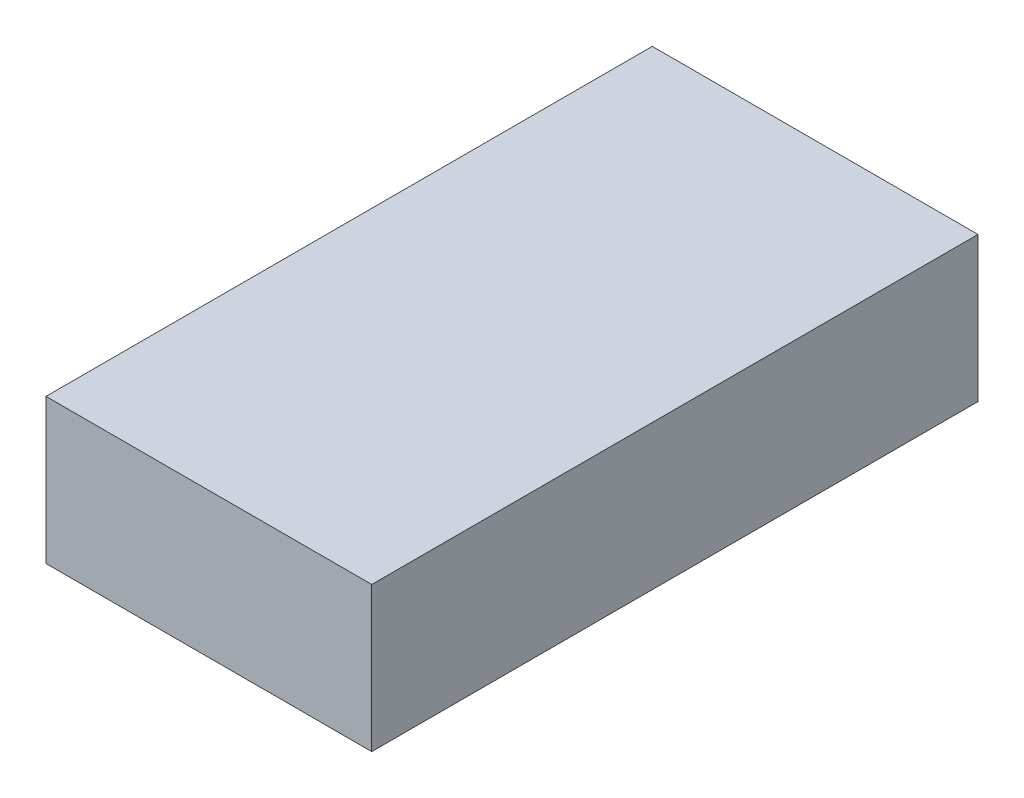
ISO-10303-21;
HEADER;
FILE_DESCRIPTION(('STEP AP214'),'2;1');
FILE_NAME('part.step','',(''),(''),'','','');
FILE_SCHEMA(('AUTOMOTIVE_DESIGN { 1 0 10303 214 1 1 1 1 }'));
ENDSEC;
DATA;
#1=APPLICATION_CONTEXT('core data for automotive mechanical design processes');
#2=APPLICATION_PROTOCOL_DEFINITION('international standard','automotive_design',2000,#1);
#3=PRODUCT_CONTEXT('',#1,'mechanical');
#4=PRODUCT('Part','Part','',(#3));
#5=PRODUCT_RELATED_PRODUCT_CATEGORY('part','',(#4));
#6=PRODUCT_DEFINITION_FORMATION('','',#4);
#7=PRODUCT_DEFINITION_CONTEXT('part definition',#1,'design');
#8=PRODUCT_DEFINITION('design','',#6,#7);
#9=PRODUCT_DEFINITION_SHAPE('','',#8);
#10=(LENGTH_UNIT() NAMED_UNIT(*) SI_UNIT(.MILLI.,.METRE.));
#11=(NAMED_UNIT(*) PLANE_ANGLE_UNIT() SI_UNIT($,.RADIAN.));
#12=(NAMED_UNIT(*) SI_UNIT($,.STERADIAN.) SOLID_ANGLE_UNIT());
#13=UNCERTAINTY_MEASURE_WITH_UNIT(LENGTH_MEASURE(1.E-05),#10,'distance_accuracy_value','');
#14=(GEOMETRIC_REPRESENTATION_CONTEXT(3) GLOBAL_UNCERTAINTY_ASSIGNED_CONTEXT((#13)) GLOBAL_UNIT_ASSIGNED_CONTEXT((#10,
#11,#12)) REPRESENTATION_CONTEXT('',''));
#15=CARTESIAN_POINT('',(0.,0.,0.));
#16=DIRECTION('',(0.,0.,1.));
#17=DIRECTION('',(1.,0.,0.));
#18=AXIS2_PLACEMENT_3D('',#15,#16,#17);
#19=CARTESIAN_POINT('',(0.,50.8,0.));
#20=DIRECTION('',(1.,0.,0.));
#21=DIRECTION('',(0.,0.,-1.));
#22=AXIS2_PLACEMENT_3D('',#19,#20,#21);
#23=PLANE('',#22);
#24=DIRECTION('',(0.,0.,1.));
#25=VECTOR('',#24,1.);
#26=CARTESIAN_POINT('',(0.,0.,0.));
#27=LINE('',#26,#25);
#28=CARTESIAN_POINT('',(0.,0.,-212.725));
#29=VERTEX_POINT('',#28);
#30=CARTESIAN_POINT('',(0.,0.,0.));
#31=VERTEX_POINT('',#30);
#32=EDGE_CURVE('E96',#29,#31,#27,.T.);
#33=ORIENTED_EDGE('',*,*,#32,.T.);
#34=DIRECTION('',(0.,-1.,0.));
#35=VECTOR('',#34,1.);
#36=CARTESIAN_POINT('',(0.,50.8,0.));
#37=LINE('',#36,#35);
#38=CARTESIAN_POINT('',(0.,50.8,0.));
#39=VERTEX_POINT('',#38);
#40=EDGE_CURVE('E11',#39,#31,#37,.T.);
#41=ORIENTED_EDGE('',*,*,#40,.F.);
#42=DIRECTION('',(0.,0.,1.));
#43=VECTOR('',#42,1.);
#44=CARTESIAN_POINT('',(0.,50.8,0.));
#45=LINE('',#44,#43);
#46=CARTESIAN_POINT('',(0.,50.8,-212.725));
#47=VERTEX_POINT('',#46);
#48=EDGE_CURVE('E84',#47,#39,#45,.T.);
#49=ORIENTED_EDGE('',*,*,#48,.F.);
#50=DIRECTION('',(0.,-1.,0.));
#51=VECTOR('',#50,1.);
#52=CARTESIAN_POINT('',(0.,50.8,-212.725));
#53=LINE('',#52,#51);
#54=EDGE_CURVE('E92',#47,#29,#53,.T.);
#55=ORIENTED_EDGE('',*,*,#54,.T.);
#56=EDGE_LOOP('',(#33,#41,#49,#55));
#57=FACE_BOUND('',#56,.T.);
#58=ADVANCED_FACE('F33',(#57),#23,.F.);
#59=CARTESIAN_POINT('',(0.,50.8,0.));
#60=DIRECTION('',(0.,0.,-1.));
#61=DIRECTION('',(-1.,0.,0.));
#62=AXIS2_PLACEMENT_3D('',#59,#60,#61);
#63=PLANE('',#62);
#64=DIRECTION('',(1.,0.,0.));
#65=VECTOR('',#64,1.);
#66=CARTESIAN_POINT('',(0.,0.,0.));
#67=LINE('',#66,#65);
#68=CARTESIAN_POINT('',(114.3,0.,0.));
#69=VERTEX_POINT('',#68);
#70=EDGE_CURVE('E88',#31,#69,#67,.T.);
#71=ORIENTED_EDGE('',*,*,#70,.T.);
#72=DIRECTION('',(0.,-1.,0.));
#73=VECTOR('',#72,1.);
#74=CARTESIAN_POINT('',(114.3,50.8,0.));
#75=LINE('',#74,#73);
#76=CARTESIAN_POINT('',(114.3,50.8,0.));
#77=VERTEX_POINT('',#76);
#78=EDGE_CURVE('E41',#77,#69,#75,.T.);
#79=ORIENTED_EDGE('',*,*,#78,.F.);
#80=DIRECTION('',(1.,0.,0.));
#81=VECTOR('',#80,1.);
#82=CARTESIAN_POINT('',(0.,50.8,0.));
#83=LINE('',#82,#81);
#84=EDGE_CURVE('E79',#39,#77,#83,.T.);
#85=ORIENTED_EDGE('',*,*,#84,.F.);
#86=ORIENTED_EDGE('',*,*,#40,.T.);
#87=EDGE_LOOP('',(#71,#79,#85,#86));
#88=FACE_BOUND('',#87,.T.);
#89=ADVANCED_FACE('F87',(#88),#63,.F.);
#90=CARTESIAN_POINT('',(114.3,50.8,0.));
#91=DIRECTION('',(-1.,0.,0.));
#92=DIRECTION('',(0.,0.,1.));
#93=AXIS2_PLACEMENT_3D('',#90,#91,#92);
#94=PLANE('',#93);
#95=DIRECTION('',(0.,0.,-1.));
#96=VECTOR('',#95,1.);
#97=CARTESIAN_POINT('',(114.3,0.,0.));
#98=LINE('',#97,#96);
#99=CARTESIAN_POINT('',(114.3,0.,-212.725));
#100=VERTEX_POINT('',#99);
#101=EDGE_CURVE('E66',#69,#100,#98,.T.);
#102=ORIENTED_EDGE('',*,*,#101,.T.);
#103=DIRECTION('',(0.,-1.,0.));
#104=VECTOR('',#103,1.);
#105=CARTESIAN_POINT('',(114.3,50.8,-212.725));
#106=LINE('',#105,#104);
#107=CARTESIAN_POINT('',(114.3,50.8,-212.725));
#108=VERTEX_POINT('',#107);
#109=EDGE_CURVE('E89',#108,#100,#106,.T.);
#110=ORIENTED_EDGE('',*,*,#109,.F.);
#111=DIRECTION('',(0.,0.,-1.));
#112=VECTOR('',#111,1.);
#113=CARTESIAN_POINT('',(114.3,50.8,0.));
#114=LINE('',#113,#112);
#115=EDGE_CURVE('E82',#77,#108,#114,.T.);
#116=ORIENTED_EDGE('',*,*,#115,.F.);
#117=ORIENTED_EDGE('',*,*,#78,.T.);
#118=EDGE_LOOP('',(#102,#110,#116,#117));
#119=FACE_BOUND('',#118,.T.);
#120=ADVANCED_FACE('F90',(#119),#94,.F.);
#121=CARTESIAN_POINT('',(0.,50.8,-212.725));
#122=DIRECTION('',(0.,0.,1.));
#123=DIRECTION('',(1.,0.,0.));
#124=AXIS2_PLACEMENT_3D('',#121,#122,#123);
#125=PLANE('',#124);
#126=DIRECTION('',(-1.,0.,0.));
#127=VECTOR('',#126,1.);
#128=CARTESIAN_POINT('',(0.,0.,-212.725));
#129=LINE('',#128,#127);
#130=EDGE_CURVE('E72',#100,#29,#129,.T.);
#131=ORIENTED_EDGE('',*,*,#130,.T.);
#132=ORIENTED_EDGE('',*,*,#54,.F.);
#133=DIRECTION('',(-1.,0.,0.));
#134=VECTOR('',#133,1.);
#135=CARTESIAN_POINT('',(0.,50.8,-212.725));
#136=LINE('',#135,#134);
#137=EDGE_CURVE('E49',#108,#47,#136,.T.);
#138=ORIENTED_EDGE('',*,*,#137,.F.);
#139=ORIENTED_EDGE('',*,*,#109,.T.);
#140=EDGE_LOOP('',(#131,#132,#138,#139));
#141=FACE_BOUND('',#140,.T.);
#142=ADVANCED_FACE('F103',(#141),#125,.F.);
#143=CARTESIAN_POINT('',(0.,50.8,0.));
#144=DIRECTION('',(0.,-1.,0.));
#145=DIRECTION('',(0.,0.,-1.));
#146=AXIS2_PLACEMENT_3D('',#143,#144,#145);
#147=PLANE('',#146);
#148=ORIENTED_EDGE('',*,*,#48,.T.);
#149=ORIENTED_EDGE('',*,*,#84,.T.);
#150=ORIENTED_EDGE('',*,*,#115,.T.);
#151=ORIENTED_EDGE('',*,*,#137,.T.);
#152=EDGE_LOOP('',(#148,#149,#150,#151));
#153=FACE_BOUND('',#152,.T.);
#154=ADVANCED_FACE('F80',(#153),#147,.F.);
#155=CARTESIAN_POINT('',(0.,0.,0.));
#156=DIRECTION('',(0.,-1.,0.));
#157=DIRECTION('',(0.,0.,-1.));
#158=AXIS2_PLACEMENT_3D('',#155,#156,#157);
#159=PLANE('',#158);
#160=ORIENTED_EDGE('',*,*,#32,.F.);
#161=ORIENTED_EDGE('',*,*,#130,.F.);
#162=ORIENTED_EDGE('',*,*,#101,.F.);
#163=ORIENTED_EDGE('',*,*,#70,.F.);
#164=EDGE_LOOP('',(#160,#161,#162,#163));
#165=FACE_BOUND('',#164,.T.);
#166=ADVANCED_FACE('F106',(#165),#159,.T.);
#167=CLOSED_SHELL('',(#58,#89,#120,#142,#154,#166));
#168=MANIFOLD_SOLID_BREP('B2',#167);
#169=ADVANCED_BREP_SHAPE_REPRESENTATION('',(#18,#168),#14);
#170=SHAPE_DEFINITION_REPRESENTATION(#9,#169);
ENDSEC;
END-ISO-10303-21;
